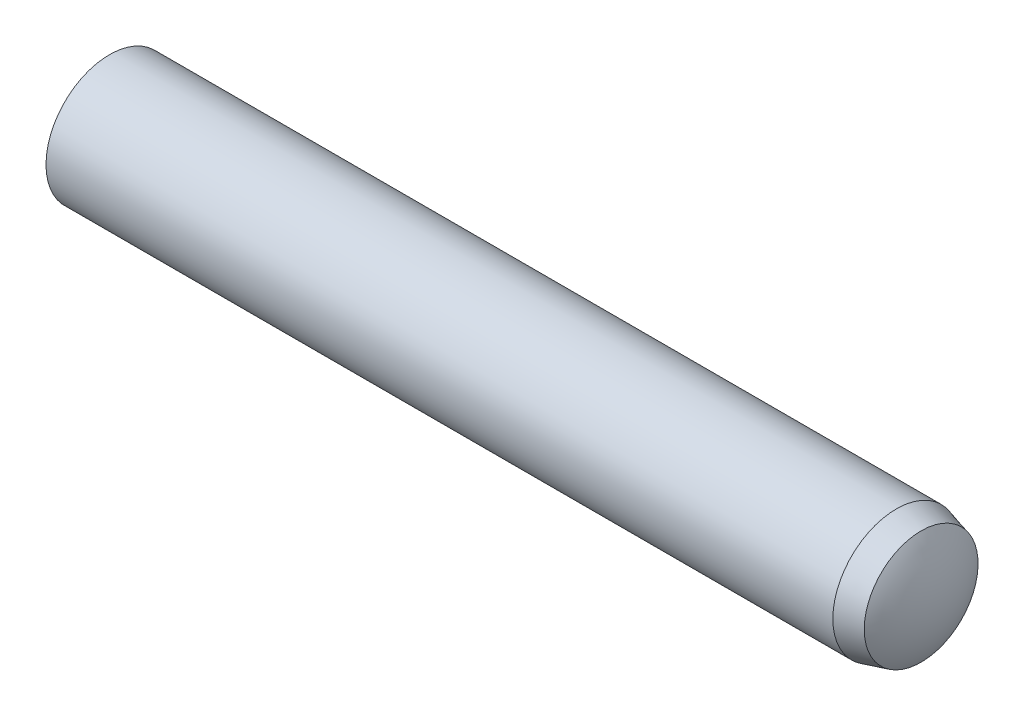
ISO-10303-21;
HEADER;
FILE_DESCRIPTION(('STEP AP214'),'2;1');
FILE_NAME('part.step','',(''),(''),'','','');
FILE_SCHEMA(('AUTOMOTIVE_DESIGN { 1 0 10303 214 1 1 1 1 }'));
ENDSEC;
DATA;
#1=APPLICATION_CONTEXT('core data for automotive mechanical design processes');
#2=APPLICATION_PROTOCOL_DEFINITION('international standard','automotive_design',2000,#1);
#3=PRODUCT_CONTEXT('',#1,'mechanical');
#4=PRODUCT('Part','Part','',(#3));
#5=PRODUCT_RELATED_PRODUCT_CATEGORY('part','',(#4));
#6=PRODUCT_DEFINITION_FORMATION('','',#4);
#7=PRODUCT_DEFINITION_CONTEXT('part definition',#1,'design');
#8=PRODUCT_DEFINITION('design','',#6,#7);
#9=PRODUCT_DEFINITION_SHAPE('','',#8);
#10=(LENGTH_UNIT() NAMED_UNIT(*) SI_UNIT(.MILLI.,.METRE.));
#11=(NAMED_UNIT(*) PLANE_ANGLE_UNIT() SI_UNIT($,.RADIAN.));
#12=(NAMED_UNIT(*) SI_UNIT($,.STERADIAN.) SOLID_ANGLE_UNIT());
#13=UNCERTAINTY_MEASURE_WITH_UNIT(LENGTH_MEASURE(1.E-05),#10,'distance_accuracy_value','');
#14=(GEOMETRIC_REPRESENTATION_CONTEXT(3) GLOBAL_UNCERTAINTY_ASSIGNED_CONTEXT((#13)) GLOBAL_UNIT_ASSIGNED_CONTEXT((#10,
#11,#12)) REPRESENTATION_CONTEXT('',''));
#15=CARTESIAN_POINT('',(0.,0.,0.));
#16=DIRECTION('',(0.,0.,1.));
#17=DIRECTION('',(1.,0.,0.));
#18=AXIS2_PLACEMENT_3D('',#15,#16,#17);
#19=CARTESIAN_POINT('',(-20.,0.,0.));
#20=DIRECTION('',(1.,0.,0.));
#21=DIRECTION('',(0.,0.,-1.));
#22=AXIS2_PLACEMENT_3D('',#19,#20,#21);
#23=CYLINDRICAL_SURFACE('',#22,3.);
#24=CARTESIAN_POINT('',(18.05,0.,0.));
#25=DIRECTION('',(-1.,0.,0.));
#26=DIRECTION('',(0.,0.,1.));
#27=AXIS2_PLACEMENT_3D('',#24,#25,#26);
#28=CIRCLE('',#27,3.);
#29=CARTESIAN_POINT('',(18.05,0.,3.));
#30=VERTEX_POINT('',#29);
#31=EDGE_CURVE('E11',#30,#30,#28,.T.);
#32=ORIENTED_EDGE('',*,*,#31,.T.);
#33=EDGE_LOOP('',(#32));
#34=FACE_BOUND('',#33,.T.);
#35=CARTESIAN_POINT('',(-19.1,0.,0.));
#36=DIRECTION('',(-1.,0.,0.));
#37=DIRECTION('',(0.,0.,1.));
#38=AXIS2_PLACEMENT_3D('',#35,#36,#37);
#39=CIRCLE('',#38,3.);
#40=CARTESIAN_POINT('',(-19.1,0.,3.));
#41=VERTEX_POINT('',#40);
#42=EDGE_CURVE('E54',#41,#41,#39,.T.);
#43=ORIENTED_EDGE('',*,*,#42,.F.);
#44=EDGE_LOOP('',(#43));
#45=FACE_BOUND('',#44,.T.);
#46=ADVANCED_FACE('F34',(#34,#45),#23,.T.);
#47=CARTESIAN_POINT('',(18.05,0.,0.));
#48=DIRECTION('',(-1.,0.,0.));
#49=DIRECTION('',(0.,0.,1.));
#50=AXIS2_PLACEMENT_3D('',#47,#48,#49);
#51=CONICAL_SURFACE('',#50,3.,0.26179938779915);
#52=CARTESIAN_POINT('',(19.22,0.,0.));
#53=DIRECTION('',(-1.,0.,0.));
#54=DIRECTION('',(0.,0.,1.));
#55=AXIS2_PLACEMENT_3D('',#52,#53,#54);
#56=CIRCLE('',#55,2.68649944485558);
#57=CARTESIAN_POINT('',(19.22,0.,2.68649944485558));
#58=VERTEX_POINT('',#57);
#59=EDGE_CURVE('E41',#58,#58,#56,.T.);
#60=ORIENTED_EDGE('',*,*,#59,.T.);
#61=EDGE_LOOP('',(#60));
#62=FACE_BOUND('',#61,.T.);
#63=ORIENTED_EDGE('',*,*,#31,.F.);
#64=EDGE_LOOP('',(#63));
#65=FACE_BOUND('',#64,.T.);
#66=ADVANCED_FACE('F60',(#62,#65),#51,.T.);
#67=CARTESIAN_POINT('',(14.9835389312761,0.,0.));
#68=DIRECTION('',(-1.,0.,0.));
#69=DIRECTION('',(0.,1.,0.));
#70=AXIS2_PLACEMENT_3D('',#67,#68,#69);
#71=SPHERICAL_SURFACE('',#70,5.01646106872393);
#72=CARTESIAN_POINT('',(20.,0.,0.));
#73=VERTEX_POINT('',#72);
#74=VERTEX_LOOP('',#73);
#75=FACE_BOUND('',#74,.T.);
#76=ORIENTED_EDGE('',*,*,#59,.F.);
#77=EDGE_LOOP('',(#76));
#78=FACE_BOUND('',#77,.T.);
#79=ADVANCED_FACE('F50',(#75,#78),#71,.T.);
#80=CARTESIAN_POINT('',(-14.55,0.,0.));
#81=DIRECTION('',(-1.,0.,0.));
#82=DIRECTION('',(0.,-1.,0.));
#83=AXIS2_PLACEMENT_3D('',#80,#81,#82);
#84=SPHERICAL_SURFACE('',#83,5.44999999999999);
#85=CARTESIAN_POINT('',(-20.,0.,0.));
#86=VERTEX_POINT('',#85);
#87=VERTEX_LOOP('',#86);
#88=FACE_BOUND('',#87,.T.);
#89=ORIENTED_EDGE('',*,*,#42,.T.);
#90=EDGE_LOOP('',(#89));
#91=FACE_BOUND('',#90,.T.);
#92=ADVANCED_FACE('F47',(#88,#91),#84,.T.);
#93=CLOSED_SHELL('',(#46,#66,#79,#92));
#94=MANIFOLD_SOLID_BREP('B2',#93);
#95=ADVANCED_BREP_SHAPE_REPRESENTATION('',(#18,#94),#14);
#96=SHAPE_DEFINITION_REPRESENTATION(#9,#95);
ENDSEC;
END-ISO-10303-21;
